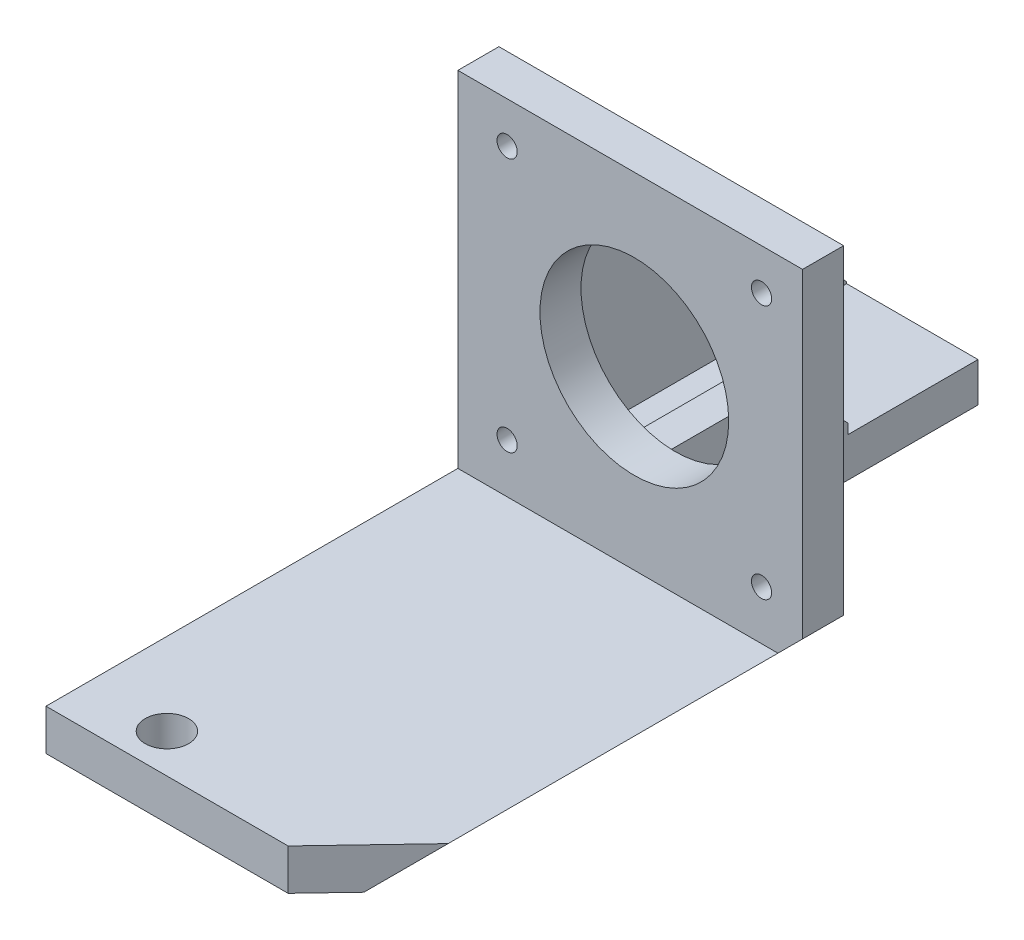
ISO-10303-21;
HEADER;
FILE_DESCRIPTION(('STEP AP214'),'2;1');
FILE_NAME('part.step','',(''),(''),'','','');
FILE_SCHEMA(('AUTOMOTIVE_DESIGN { 1 0 10303 214 1 1 1 1 }'));
ENDSEC;
DATA;
#1=APPLICATION_CONTEXT('core data for automotive mechanical design processes');
#2=APPLICATION_PROTOCOL_DEFINITION('international standard','automotive_design',2000,#1);
#3=PRODUCT_CONTEXT('',#1,'mechanical');
#4=PRODUCT('Part','Part','',(#3));
#5=PRODUCT_RELATED_PRODUCT_CATEGORY('part','',(#4));
#6=PRODUCT_DEFINITION_FORMATION('','',#4);
#7=PRODUCT_DEFINITION_CONTEXT('part definition',#1,'design');
#8=PRODUCT_DEFINITION('design','',#6,#7);
#9=PRODUCT_DEFINITION_SHAPE('','',#8);
#10=(LENGTH_UNIT() NAMED_UNIT(*) SI_UNIT(.MILLI.,.METRE.));
#11=(NAMED_UNIT(*) PLANE_ANGLE_UNIT() SI_UNIT($,.RADIAN.));
#12=(NAMED_UNIT(*) SI_UNIT($,.STERADIAN.) SOLID_ANGLE_UNIT());
#13=UNCERTAINTY_MEASURE_WITH_UNIT(LENGTH_MEASURE(1.E-05),#10,'distance_accuracy_value','');
#14=(GEOMETRIC_REPRESENTATION_CONTEXT(3) GLOBAL_UNCERTAINTY_ASSIGNED_CONTEXT((#13)) GLOBAL_UNIT_ASSIGNED_CONTEXT((#10,
#11,#12)) REPRESENTATION_CONTEXT('',''));
#15=CARTESIAN_POINT('',(0.,0.,0.));
#16=DIRECTION('',(0.,0.,1.));
#17=DIRECTION('',(1.,0.,0.));
#18=AXIS2_PLACEMENT_3D('',#15,#16,#17);
#19=CARTESIAN_POINT('',(-174.000000052158,-112.694250021961,-39.4500000000026));
#20=DIRECTION('',(0.,0.,1.));
#21=DIRECTION('',(1.,0.,0.));
#22=AXIS2_PLACEMENT_3D('',#19,#20,#21);
#23=CYLINDRICAL_SURFACE('',#22,1.23);
#24=CARTESIAN_POINT('',(-174.000000052157,-112.694250021962,-30.4500000000025));
#25=DIRECTION('',(0.,0.,-1.));
#26=DIRECTION('',(1.,0.,0.));
#27=AXIS2_PLACEMENT_3D('',#24,#25,#26);
#28=CIRCLE('',#27,1.23);
#29=CARTESIAN_POINT('',(-175.230000052157,-112.694250021962,-30.4500000000025));
#30=VERTEX_POINT('',#29);
#31=EDGE_CURVE('E403',#30,#30,#28,.T.);
#32=ORIENTED_EDGE('',*,*,#31,.T.);
#33=DIRECTION('',(0.,0.,1.));
#34=VECTOR('',#33,1.);
#35=CARTESIAN_POINT('',(-175.230000052158,-112.694250021961,-39.4500000000025));
#36=LINE('',#35,#34);
#37=CARTESIAN_POINT('',(-175.230000052157,-112.694250021962,-25.4500000000025));
#38=VERTEX_POINT('',#37);
#39=EDGE_CURVE('E11',#30,#38,#36,.T.);
#40=ORIENTED_EDGE('',*,*,#39,.T.);
#41=CARTESIAN_POINT('',(-174.000000052157,-112.694250021962,-25.4500000000026));
#42=DIRECTION('',(0.,0.,-1.));
#43=DIRECTION('',(1.,0.,0.));
#44=AXIS2_PLACEMENT_3D('',#41,#42,#43);
#45=CIRCLE('',#44,1.23);
#46=EDGE_CURVE('E370',#38,#38,#45,.T.);
#47=ORIENTED_EDGE('',*,*,#46,.F.);
#48=ORIENTED_EDGE('',*,*,#39,.F.);
#49=EDGE_LOOP('',(#32,#40,#47,#48));
#50=FACE_BOUND('',#49,.T.);
#51=ADVANCED_FACE('F16',(#50),#23,.F.);
#52=CARTESIAN_POINT('',(-174.000000052157,-143.694250021961,-39.4500000000027));
#53=DIRECTION('',(0.,0.,1.));
#54=DIRECTION('',(1.,0.,0.));
#55=AXIS2_PLACEMENT_3D('',#52,#53,#54);
#56=CYLINDRICAL_SURFACE('',#55,1.23);
#57=CARTESIAN_POINT('',(-174.000000052157,-143.694250021961,-30.4500000000028));
#58=DIRECTION('',(0.,0.,-1.));
#59=DIRECTION('',(1.,0.,0.));
#60=AXIS2_PLACEMENT_3D('',#57,#58,#59);
#61=CIRCLE('',#60,1.23);
#62=CARTESIAN_POINT('',(-175.230000052157,-143.694250021961,-30.4500000000027));
#63=VERTEX_POINT('',#62);
#64=EDGE_CURVE('E399',#63,#63,#61,.T.);
#65=ORIENTED_EDGE('',*,*,#64,.T.);
#66=DIRECTION('',(0.,0.,1.));
#67=VECTOR('',#66,1.);
#68=CARTESIAN_POINT('',(-175.230000052157,-143.694250021961,-39.4500000000027));
#69=LINE('',#68,#67);
#70=CARTESIAN_POINT('',(-175.230000052157,-143.694250021962,-25.4500000000027));
#71=VERTEX_POINT('',#70);
#72=EDGE_CURVE('E20',#63,#71,#69,.T.);
#73=ORIENTED_EDGE('',*,*,#72,.T.);
#74=CARTESIAN_POINT('',(-174.000000052157,-143.694250021962,-25.4500000000027));
#75=DIRECTION('',(0.,0.,-1.));
#76=DIRECTION('',(1.,0.,0.));
#77=AXIS2_PLACEMENT_3D('',#74,#75,#76);
#78=CIRCLE('',#77,1.23);
#79=EDGE_CURVE('E424',#71,#71,#78,.T.);
#80=ORIENTED_EDGE('',*,*,#79,.F.);
#81=ORIENTED_EDGE('',*,*,#72,.F.);
#82=EDGE_LOOP('',(#65,#73,#80,#81));
#83=FACE_BOUND('',#82,.T.);
#84=ADVANCED_FACE('F864',(#83),#56,.F.);
#85=CARTESIAN_POINT('',(-143.000000052158,-112.694250021961,-39.4500000000036));
#86=DIRECTION('',(0.,0.,1.));
#87=DIRECTION('',(1.,0.,0.));
#88=AXIS2_PLACEMENT_3D('',#85,#86,#87);
#89=CYLINDRICAL_SURFACE('',#88,1.23);
#90=CARTESIAN_POINT('',(-143.000000052157,-112.694250021961,-30.4500000000035));
#91=DIRECTION('',(0.,0.,-1.));
#92=DIRECTION('',(1.,0.,0.));
#93=AXIS2_PLACEMENT_3D('',#90,#91,#92);
#94=CIRCLE('',#93,1.23);
#95=CARTESIAN_POINT('',(-144.230000052157,-112.694250021961,-30.4500000000035));
#96=VERTEX_POINT('',#95);
#97=EDGE_CURVE('E239',#96,#96,#94,.T.);
#98=ORIENTED_EDGE('',*,*,#97,.T.);
#99=DIRECTION('',(0.,0.,1.));
#100=VECTOR('',#99,1.);
#101=CARTESIAN_POINT('',(-144.230000052157,-112.694250021961,-39.4500000000035));
#102=LINE('',#101,#100);
#103=CARTESIAN_POINT('',(-144.230000052157,-112.694250021961,-25.4500000000035));
#104=VERTEX_POINT('',#103);
#105=EDGE_CURVE('E236',#96,#104,#102,.T.);
#106=ORIENTED_EDGE('',*,*,#105,.T.);
#107=CARTESIAN_POINT('',(-143.000000052157,-112.694250021961,-25.4500000000036));
#108=DIRECTION('',(0.,0.,-1.));
#109=DIRECTION('',(1.,0.,0.));
#110=AXIS2_PLACEMENT_3D('',#107,#108,#109);
#111=CIRCLE('',#110,1.23);
#112=EDGE_CURVE('E241',#104,#104,#111,.T.);
#113=ORIENTED_EDGE('',*,*,#112,.F.);
#114=ORIENTED_EDGE('',*,*,#105,.F.);
#115=EDGE_LOOP('',(#98,#106,#113,#114));
#116=FACE_BOUND('',#115,.T.);
#117=ADVANCED_FACE('F237',(#116),#89,.F.);
#118=CARTESIAN_POINT('',(-143.000000052157,-143.694250021961,-39.4500000000037));
#119=DIRECTION('',(0.,0.,1.));
#120=DIRECTION('',(1.,0.,0.));
#121=AXIS2_PLACEMENT_3D('',#118,#119,#120);
#122=CYLINDRICAL_SURFACE('',#121,1.23);
#123=CARTESIAN_POINT('',(-143.000000052157,-143.694250021961,-30.4500000000037));
#124=DIRECTION('',(0.,0.,-1.));
#125=DIRECTION('',(1.,0.,0.));
#126=AXIS2_PLACEMENT_3D('',#123,#124,#125);
#127=CIRCLE('',#126,1.23);
#128=CARTESIAN_POINT('',(-144.230000052157,-143.694250021961,-30.4500000000037));
#129=VERTEX_POINT('',#128);
#130=EDGE_CURVE('E383',#129,#129,#127,.T.);
#131=ORIENTED_EDGE('',*,*,#130,.T.);
#132=DIRECTION('',(0.,0.,1.));
#133=VECTOR('',#132,1.);
#134=CARTESIAN_POINT('',(-144.230000052157,-143.694250021961,-39.4500000000037));
#135=LINE('',#134,#133);
#136=CARTESIAN_POINT('',(-144.230000052157,-143.694250021961,-25.4500000000037));
#137=VERTEX_POINT('',#136);
#138=EDGE_CURVE('E120',#129,#137,#135,.T.);
#139=ORIENTED_EDGE('',*,*,#138,.T.);
#140=CARTESIAN_POINT('',(-143.000000052157,-143.694250021961,-25.4500000000037));
#141=DIRECTION('',(0.,0.,-1.));
#142=DIRECTION('',(1.,0.,0.));
#143=AXIS2_PLACEMENT_3D('',#140,#141,#142);
#144=CIRCLE('',#143,1.23);
#145=EDGE_CURVE('E252',#137,#137,#144,.T.);
#146=ORIENTED_EDGE('',*,*,#145,.F.);
#147=ORIENTED_EDGE('',*,*,#138,.F.);
#148=EDGE_LOOP('',(#131,#139,#146,#147));
#149=FACE_BOUND('',#148,.T.);
#150=ADVANCED_FACE('F672',(#149),#122,.F.);
#151=CARTESIAN_POINT('',(-180.00025649192,-150.000002235174,-69.0000013261975));
#152=DIRECTION('',(0.,1.,0.));
#153=DIRECTION('',(0.,0.,-1.));
#154=AXIS2_PLACEMENT_3D('',#151,#152,#153);
#155=PLANE('',#154);
#156=DIRECTION('',(0.,0.,1.));
#157=VECTOR('',#156,1.);
#158=CARTESIAN_POINT('',(-180.000000052441,-150.000002235174,-54.2250006631001));
#159=LINE('',#158,#157);
#160=CARTESIAN_POINT('',(-180.000000052442,-150.000002235174,-69.0000013261975));
#161=VERTEX_POINT('',#160);
#162=CARTESIAN_POINT('',(-180.000000052442,-150.000002235174,-68.8225735100148));
#163=VERTEX_POINT('',#162);
#164=EDGE_CURVE('E362',#161,#163,#159,.T.);
#165=ORIENTED_EDGE('',*,*,#164,.T.);
#166=DIRECTION('',(0.,0.,1.));
#167=VECTOR('',#166,1.);
#168=CARTESIAN_POINT('',(-180.000000052441,-150.000002235174,-54.2250006631001));
#169=LINE('',#168,#167);
#170=CARTESIAN_POINT('',(-180.000000052441,-150.000002235174,-44.4500000000023));
#171=VERTEX_POINT('',#170);
#172=EDGE_CURVE('E275',#163,#171,#169,.T.);
#173=ORIENTED_EDGE('',*,*,#172,.T.);
#174=DIRECTION('',(1.,0.,0.));
#175=VECTOR('',#174,1.);
#176=CARTESIAN_POINT('',(-180.000256491919,-150.000002235174,-44.4500000000023));
#177=LINE('',#176,#175);
#178=CARTESIAN_POINT('',(-180.000256491919,-150.000002235174,-44.4500000000023));
#179=VERTEX_POINT('',#178);
#180=EDGE_CURVE('E266',#179,#171,#177,.T.);
#181=ORIENTED_EDGE('',*,*,#180,.F.);
#182=DIRECTION('',(0.,0.,1.));
#183=VECTOR('',#182,1.);
#184=CARTESIAN_POINT('',(-180.00025649192,-150.000002235174,-69.0000013261975));
#185=LINE('',#184,#183);
#186=CARTESIAN_POINT('',(-180.00025649192,-150.000002235174,-69.0000013261975));
#187=VERTEX_POINT('',#186);
#188=EDGE_CURVE('E334',#187,#179,#185,.T.);
#189=ORIENTED_EDGE('',*,*,#188,.F.);
#190=DIRECTION('',(1.,0.,0.));
#191=VECTOR('',#190,1.);
#192=CARTESIAN_POINT('',(-180.00025649192,-150.000002235174,-69.0000013261975));
#193=LINE('',#192,#191);
#194=EDGE_CURVE('E107',#187,#161,#193,.T.);
#195=ORIENTED_EDGE('',*,*,#194,.T.);
#196=EDGE_LOOP('',(#165,#173,#181,#189,#195));
#197=FACE_BOUND('',#196,.T.);
#198=ADVANCED_FACE('F964',(#197),#155,.F.);
#199=CARTESIAN_POINT('',(-180.000256491919,-107.694249950324,-44.4500000000023));
#200=DIRECTION('',(0.,-0.501911828507545,0.864918791797365));
#201=DIRECTION('',(-1.,0.,0.));
#202=AXIS2_PLACEMENT_3D('',#199,#200,#201);
#203=PLANE('',#202);
#204=DIRECTION('',(1.,0.,0.));
#205=VECTOR('',#204,1.);
#206=CARTESIAN_POINT('',(-178.00025649192,-149.694250021961,-68.8225735100149));
#207=LINE('',#206,#205);
#208=CARTESIAN_POINT('',(-180.00025649192,-149.694250021961,-68.8225735100148));
#209=VERTEX_POINT('',#208);
#210=CARTESIAN_POINT('',(-180.000000052158,-149.694250021961,-68.8225735100148));
#211=VERTEX_POINT('',#210);
#212=EDGE_CURVE('E259',#209,#211,#207,.T.);
#213=ORIENTED_EDGE('',*,*,#212,.T.);
#214=DIRECTION('',(0.,-0.864918791797365,-0.501911828507545));
#215=VECTOR('',#214,1.);
#216=CARTESIAN_POINT('',(-180.000000052441,-107.99559620047,-44.6248710386004));
#217=LINE('',#216,#215);
#218=EDGE_CURVE('E355',#211,#161,#217,.T.);
#219=ORIENTED_EDGE('',*,*,#218,.T.);
#220=ORIENTED_EDGE('',*,*,#194,.F.);
#221=DIRECTION('',(0.,-0.864918791797365,-0.501911828507545));
#222=VECTOR('',#221,1.);
#223=CARTESIAN_POINT('',(-180.000256491919,-107.694249950324,-44.4500000000023));
#224=LINE('',#223,#222);
#225=EDGE_CURVE('E330',#209,#187,#224,.T.);
#226=ORIENTED_EDGE('',*,*,#225,.F.);
#227=EDGE_LOOP('',(#213,#219,#220,#226));
#228=FACE_BOUND('',#227,.T.);
#229=ADVANCED_FACE('F885',(#228),#203,.F.);
#230=CARTESIAN_POINT('',(-180.000256491919,-150.000002235174,-44.4500000000023));
#231=DIRECTION('',(0.,0.,-1.));
#232=DIRECTION('',(-1.,0.,0.));
#233=AXIS2_PLACEMENT_3D('',#230,#231,#232);
#234=PLANE('',#233);
#235=DIRECTION('',(-1.,0.,0.));
#236=VECTOR('',#235,1.);
#237=CARTESIAN_POINT('',(-178.000256491919,-123.017694463356,-44.4500000000024));
#238=LINE('',#237,#236);
#239=CARTESIAN_POINT('',(-180.000000052441,-123.017694463356,-44.4500000000023));
#240=VERTEX_POINT('',#239);
#241=CARTESIAN_POINT('',(-180.000256491919,-123.017694463356,-44.4500000000023));
#242=VERTEX_POINT('',#241);
#243=EDGE_CURVE('E258',#240,#242,#238,.T.);
#244=ORIENTED_EDGE('',*,*,#243,.T.);
#245=DIRECTION('',(0.,1.,0.));
#246=VECTOR('',#245,1.);
#247=CARTESIAN_POINT('',(-180.000256491919,-150.000002235174,-44.4500000000023));
#248=LINE('',#247,#246);
#249=EDGE_CURVE('E354',#179,#242,#248,.T.);
#250=ORIENTED_EDGE('',*,*,#249,.F.);
#251=ORIENTED_EDGE('',*,*,#180,.T.);
#252=DIRECTION('',(0.,1.,0.));
#253=VECTOR('',#252,1.);
#254=CARTESIAN_POINT('',(-180.000000052441,-130.700698316867,-44.4500000000023));
#255=LINE('',#254,#253);
#256=EDGE_CURVE('E329',#171,#240,#255,.T.);
#257=ORIENTED_EDGE('',*,*,#256,.T.);
#258=EDGE_LOOP('',(#244,#250,#251,#257));
#259=FACE_BOUND('',#258,.T.);
#260=ADVANCED_FACE('F503',(#259),#234,.F.);
#261=CARTESIAN_POINT('',(-176.00025649192,-128.847126092749,-56.7250006631));
#262=DIRECTION('',(-1.,0.,0.));
#263=DIRECTION('',(0.,1.,0.));
#264=AXIS2_PLACEMENT_3D('',#261,#262,#263);
#265=PLANE('',#264);
#266=DIRECTION('',(0.,0.738268850320512,0.674506563827536));
#267=VECTOR('',#266,1.);
#268=CARTESIAN_POINT('',(-176.00025649192,-141.00088532556,-60.8800312411335));
#269=LINE('',#268,#267);
#270=CARTESIAN_POINT('',(-176.00025649192,-149.694250021961,-68.822573510015));
#271=VERTEX_POINT('',#270);
#272=CARTESIAN_POINT('',(-176.000256491919,-107.694249950324,-30.4500000000024));
#273=VERTEX_POINT('',#272);
#274=EDGE_CURVE('E309',#271,#273,#269,.T.);
#275=ORIENTED_EDGE('',*,*,#274,.T.);
#276=DIRECTION('',(0.,-1.,0.));
#277=VECTOR('',#276,1.);
#278=CARTESIAN_POINT('',(-176.000256491919,-149.694250021961,-30.4500000000024));
#279=LINE('',#278,#277);
#280=CARTESIAN_POINT('',(-176.000256491919,-149.894250021961,-30.4500000000024));
#281=VERTEX_POINT('',#280);
#282=EDGE_CURVE('E558',#273,#281,#279,.T.);
#283=ORIENTED_EDGE('',*,*,#282,.T.);
#284=DIRECTION('',(0.,0.,1.));
#285=VECTOR('',#284,1.);
#286=CARTESIAN_POINT('',(-176.000256491919,-149.894250021961,-44.4500000000024));
#287=LINE('',#286,#285);
#288=CARTESIAN_POINT('',(-176.00025649192,-149.894250021961,-68.822573510015));
#289=VERTEX_POINT('',#288);
#290=EDGE_CURVE('E319',#289,#281,#287,.T.);
#291=ORIENTED_EDGE('',*,*,#290,.F.);
#292=DIRECTION('',(0.,-1.,0.));
#293=VECTOR('',#292,1.);
#294=CARTESIAN_POINT('',(-176.00025649192,-149.694250021961,-68.822573510015));
#295=LINE('',#294,#293);
#296=EDGE_CURVE('E365',#271,#289,#295,.T.);
#297=ORIENTED_EDGE('',*,*,#296,.F.);
#298=EDGE_LOOP('',(#275,#283,#291,#297));
#299=FACE_BOUND('',#298,.T.);
#300=ADVANCED_FACE('F884',(#299),#265,.F.);
#301=CARTESIAN_POINT('',(-158.500000052158,-128.194250021961,-44.4500000000031));
#302=DIRECTION('',(0.,0.,-1.));
#303=DIRECTION('',(-1.,0.,0.));
#304=AXIS2_PLACEMENT_3D('',#301,#302,#303);
#305=CYLINDRICAL_SURFACE('',#304,11.5);
#306=CARTESIAN_POINT('',(-158.500000052157,-128.194250021961,-25.4500000000031));
#307=DIRECTION('',(0.,0.,-1.));
#308=DIRECTION('',(-1.,0.,0.));
#309=AXIS2_PLACEMENT_3D('',#306,#307,#308);
#310=CIRCLE('',#309,11.5);
#311=CARTESIAN_POINT('',(-147.000000052157,-128.194250021961,-25.4500000000035));
#312=VERTEX_POINT('',#311);
#313=EDGE_CURVE('E366',#312,#312,#310,.T.);
#314=ORIENTED_EDGE('',*,*,#313,.F.);
#315=DIRECTION('',(0.,0.,-1.));
#316=VECTOR('',#315,1.);
#317=CARTESIAN_POINT('',(-147.000000052158,-128.194250021961,-44.4500000000035));
#318=LINE('',#317,#316);
#319=CARTESIAN_POINT('',(-147.000000052157,-128.194250021961,-30.4500000000035));
#320=VERTEX_POINT('',#319);
#321=EDGE_CURVE('E270',#312,#320,#318,.T.);
#322=ORIENTED_EDGE('',*,*,#321,.T.);
#323=CARTESIAN_POINT('',(-158.500000052157,-128.194250021961,-30.4500000000031));
#324=DIRECTION('',(0.,0.,-1.));
#325=DIRECTION('',(-1.,0.,0.));
#326=AXIS2_PLACEMENT_3D('',#323,#324,#325);
#327=CIRCLE('',#326,11.5);
#328=EDGE_CURVE('E386',#320,#320,#327,.T.);
#329=ORIENTED_EDGE('',*,*,#328,.T.);
#330=ORIENTED_EDGE('',*,*,#321,.F.);
#331=EDGE_LOOP('',(#314,#322,#329,#330));
#332=FACE_BOUND('',#331,.T.);
#333=ADVANCED_FACE('F18',(#332),#305,.F.);
#334=CARTESIAN_POINT('',(-161.500001173424,-140.694250021961,-53.7250006184001));
#335=DIRECTION('',(0.,-1.,0.));
#336=DIRECTION('',(0.,0.,-1.));
#337=AXIS2_PLACEMENT_3D('',#334,#335,#336);
#338=PLANE('',#337);
#339=DIRECTION('',(0.,0.,1.));
#340=VECTOR('',#339,1.);
#341=CARTESIAN_POINT('',(-160.00000005207,-140.694250021961,-74.862500309202));
#342=LINE('',#341,#340);
#343=CARTESIAN_POINT('',(-160.00000005207,-140.694250021961,-45.000001236797));
#344=VERTEX_POINT('',#343);
#345=CARTESIAN_POINT('',(-160.000000052069,-140.694250021961,-30.4500000000032));
#346=VERTEX_POINT('',#345);
#347=EDGE_CURVE('E479',#344,#346,#342,.T.);
#348=ORIENTED_EDGE('',*,*,#347,.F.);
#349=DIRECTION('',(-1.,0.,0.));
#350=VECTOR('',#349,1.);
#351=CARTESIAN_POINT('',(-162.750001734102,-140.694250021961,-45.000001236797));
#352=LINE('',#351,#350);
#353=CARTESIAN_POINT('',(-164.000002294779,-140.694250021961,-45.000001236797));
#354=VERTEX_POINT('',#353);
#355=EDGE_CURVE('E375',#344,#354,#352,.T.);
#356=ORIENTED_EDGE('',*,*,#355,.T.);
#357=DIRECTION('',(0.,0.,-1.));
#358=VECTOR('',#357,1.);
#359=CARTESIAN_POINT('',(-164.000002294779,-140.694250021961,-44.4500000000032));
#360=LINE('',#359,#358);
#361=CARTESIAN_POINT('',(-164.000002294778,-140.694250021961,-30.4500000000032));
#362=VERTEX_POINT('',#361);
#363=EDGE_CURVE('E40',#362,#354,#360,.T.);
#364=ORIENTED_EDGE('',*,*,#363,.F.);
#365=DIRECTION('',(1.,0.,0.));
#366=VECTOR('',#365,1.);
#367=CARTESIAN_POINT('',(-160.00000061279,-140.694250021961,-30.4500000000032));
#368=LINE('',#367,#366);
#369=EDGE_CURVE('E414',#362,#346,#368,.T.);
#370=ORIENTED_EDGE('',*,*,#369,.T.);
#371=EDGE_LOOP('',(#348,#356,#364,#370));
#372=FACE_BOUND('',#371,.T.);
#373=ADVANCED_FACE('F643',(#372),#338,.F.);
#374=CARTESIAN_POINT('',(-164.000002294779,-149.694250021961,-44.4500000000033));
#375=DIRECTION('',(1.,0.,0.));
#376=DIRECTION('',(0.,0.,1.));
#377=AXIS2_PLACEMENT_3D('',#374,#375,#376);
#378=PLANE('',#377);
#379=DIRECTION('',(0.,-0.707106781186544,-0.707106781186551));
#380=VECTOR('',#379,1.);
#381=CARTESIAN_POINT('',(-164.000002294779,-144.806749712763,-49.1125009275985));
#382=LINE('',#381,#380);
#383=CARTESIAN_POINT('',(-164.000002294779,-148.694250021961,-53.000001236797));
#384=VERTEX_POINT('',#383);
#385=EDGE_CURVE('E372',#354,#384,#382,.T.);
#386=ORIENTED_EDGE('',*,*,#385,.T.);
#387=DIRECTION('',(0.,1.,0.));
#388=VECTOR('',#387,1.);
#389=CARTESIAN_POINT('',(-164.000002294779,-149.694250021961,-53.000001236797));
#390=LINE('',#389,#388);
#391=CARTESIAN_POINT('',(-164.000002294779,-149.894250021961,-53.000001236797));
#392=VERTEX_POINT('',#391);
#393=EDGE_CURVE('E450',#392,#384,#390,.T.);
#394=ORIENTED_EDGE('',*,*,#393,.F.);
#395=DIRECTION('',(0.,0.,-1.));
#396=VECTOR('',#395,1.);
#397=CARTESIAN_POINT('',(-164.000002294779,-149.894250021961,-10.4500000000036));
#398=LINE('',#397,#396);
#399=CARTESIAN_POINT('',(-164.000002294778,-149.894250021961,-30.4500000000033));
#400=VERTEX_POINT('',#399);
#401=EDGE_CURVE('E344',#400,#392,#398,.T.);
#402=ORIENTED_EDGE('',*,*,#401,.F.);
#403=DIRECTION('',(0.,1.,0.));
#404=VECTOR('',#403,1.);
#405=CARTESIAN_POINT('',(-164.000002294778,-138.944250021961,-30.450000000003));
#406=LINE('',#405,#404);
#407=EDGE_CURVE('E469',#400,#362,#406,.T.);
#408=ORIENTED_EDGE('',*,*,#407,.T.);
#409=ORIENTED_EDGE('',*,*,#363,.T.);
#410=EDGE_LOOP('',(#386,#394,#402,#408,#409));
#411=FACE_BOUND('',#410,.T.);
#412=ADVANCED_FACE('F936',(#411),#378,.F.);
#413=CARTESIAN_POINT('',(-162.750001734102,-144.694250021961,-49.000001236797));
#414=DIRECTION('',(0.,-0.707106781186551,0.707106781186544));
#415=DIRECTION('',(-1.,0.,0.));
#416=AXIS2_PLACEMENT_3D('',#413,#414,#415);
#417=PLANE('',#416);
#418=DIRECTION('',(0.,0.707106781186544,0.707106781186551));
#419=VECTOR('',#418,1.);
#420=CARTESIAN_POINT('',(-160.00000005207,-157.694249712763,-62.0000009275988));
#421=LINE('',#420,#419);
#422=CARTESIAN_POINT('',(-160.00000005207,-148.694250021961,-53.000001236797));
#423=VERTEX_POINT('',#422);
#424=EDGE_CURVE('E449',#423,#344,#421,.T.);
#425=ORIENTED_EDGE('',*,*,#424,.F.);
#426=DIRECTION('',(1.,0.,0.));
#427=VECTOR('',#426,1.);
#428=CARTESIAN_POINT('',(-162.750001734102,-148.694250021961,-53.000001236797));
#429=LINE('',#428,#427);
#430=EDGE_CURVE('E376',#384,#423,#429,.T.);
#431=ORIENTED_EDGE('',*,*,#430,.F.);
#432=ORIENTED_EDGE('',*,*,#385,.F.);
#433=ORIENTED_EDGE('',*,*,#355,.F.);
#434=EDGE_LOOP('',(#425,#431,#432,#433));
#435=FACE_BOUND('',#434,.T.);
#436=ADVANCED_FACE('F639',(#435),#417,.F.);
#437=CARTESIAN_POINT('',(-164.000002294779,-149.694250021961,-53.000001236797));
#438=DIRECTION('',(0.,0.,-1.));
#439=DIRECTION('',(-1.,0.,0.));
#440=AXIS2_PLACEMENT_3D('',#437,#438,#439);
#441=PLANE('',#440);
#442=DIRECTION('',(0.,1.,0.));
#443=VECTOR('',#442,1.);
#444=CARTESIAN_POINT('',(-160.00000005207,-149.694250021961,-53.000001236797));
#445=LINE('',#444,#443);
#446=CARTESIAN_POINT('',(-160.00000005207,-149.894250021961,-53.000001236797));
#447=VERTEX_POINT('',#446);
#448=EDGE_CURVE('E435',#447,#423,#445,.T.);
#449=ORIENTED_EDGE('',*,*,#448,.F.);
#450=DIRECTION('',(1.,0.,0.));
#451=VECTOR('',#450,1.);
#452=CARTESIAN_POINT('',(-151.000001173379,-149.894250021961,-53.000001236797));
#453=LINE('',#452,#451);
#454=EDGE_CURVE('E281',#392,#447,#453,.T.);
#455=ORIENTED_EDGE('',*,*,#454,.F.);
#456=ORIENTED_EDGE('',*,*,#393,.T.);
#457=ORIENTED_EDGE('',*,*,#430,.T.);
#458=EDGE_LOOP('',(#449,#455,#456,#457));
#459=FACE_BOUND('',#458,.T.);
#460=ADVANCED_FACE('F914',(#459),#441,.T.);
#461=CARTESIAN_POINT('',(-138.000000052157,-144.987105592628,-39.4500000000039));
#462=DIRECTION('',(-1.,0.,0.));
#463=DIRECTION('',(0.,1.,0.));
#464=AXIS2_PLACEMENT_3D('',#461,#462,#463);
#465=PLANE('',#464);
#466=DIRECTION('',(0.,1.,0.));
#467=VECTOR('',#466,1.);
#468=CARTESIAN_POINT('',(-138.000000052157,-136.590677807295,-30.4500000000039));
#469=LINE('',#468,#467);
#470=CARTESIAN_POINT('',(-138.000000052157,-146.694250021961,-30.4500000000033));
#471=VERTEX_POINT('',#470);
#472=CARTESIAN_POINT('',(-138.000000052069,-107.694249950324,-30.4500000000037));
#473=VERTEX_POINT('',#472);
#474=EDGE_CURVE('E489',#471,#473,#469,.T.);
#475=ORIENTED_EDGE('',*,*,#474,.T.);
#476=DIRECTION('',(0.,0.,-1.));
#477=VECTOR('',#476,1.);
#478=CARTESIAN_POINT('',(-138.000000052069,-107.694249950324,-39.4500000000037));
#479=LINE('',#478,#477);
#480=CARTESIAN_POINT('',(-138.000000052069,-107.694249950324,-25.4500000000037));
#481=VERTEX_POINT('',#480);
#482=EDGE_CURVE('E265',#481,#473,#479,.T.);
#483=ORIENTED_EDGE('',*,*,#482,.F.);
#484=DIRECTION('',(0.,1.,0.));
#485=VECTOR('',#484,1.);
#486=CARTESIAN_POINT('',(-138.000000052157,-148.694250021961,-25.450000000004));
#487=LINE('',#486,#485);
#488=CARTESIAN_POINT('',(-138.000000052157,-146.694250021961,-25.4500000000039));
#489=VERTEX_POINT('',#488);
#490=EDGE_CURVE('E371',#489,#481,#487,.T.);
#491=ORIENTED_EDGE('',*,*,#490,.F.);
#492=DIRECTION('',(0.,0.,1.));
#493=VECTOR('',#492,1.);
#494=CARTESIAN_POINT('',(-138.000000052157,-146.694250021961,-39.4500000000039));
#495=LINE('',#494,#493);
#496=EDGE_CURVE('E287',#471,#489,#495,.T.);
#497=ORIENTED_EDGE('',*,*,#496,.F.);
#498=EDGE_LOOP('',(#475,#483,#491,#497));
#499=FACE_BOUND('',#498,.T.);
#500=ADVANCED_FACE('F698',(#499),#465,.F.);
#501=CARTESIAN_POINT('',(-180.000000052158,-149.694250021961,-68.8225735100148));
#502=DIRECTION('',(0.,0.,-1.));
#503=DIRECTION('',(-1.,0.,0.));
#504=AXIS2_PLACEMENT_3D('',#501,#502,#503);
#505=PLANE('',#504);
#506=DIRECTION('',(-1.,0.,0.));
#507=VECTOR('',#506,1.);
#508=CARTESIAN_POINT('',(-159.000128271951,-149.694250021961,-68.8225735100156));
#509=LINE('',#508,#507);
#510=EDGE_CURVE('E313',#271,#211,#509,.T.);
#511=ORIENTED_EDGE('',*,*,#510,.F.);
#512=ORIENTED_EDGE('',*,*,#296,.T.);
#513=DIRECTION('',(-1.,0.,0.));
#514=VECTOR('',#513,1.);
#515=CARTESIAN_POINT('',(-149.000000052024,-149.894250021961,-68.8225735100148));
#516=LINE('',#515,#514);
#517=CARTESIAN_POINT('',(-160.00000005207,-149.894250021961,-68.8225735100148));
#518=VERTEX_POINT('',#517);
#519=EDGE_CURVE('E315',#518,#289,#516,.T.);
#520=ORIENTED_EDGE('',*,*,#519,.F.);
#521=DIRECTION('',(0.,1.,0.));
#522=VECTOR('',#521,1.);
#523=CARTESIAN_POINT('',(-160.00000005207,-149.794250021961,-68.8225735100148));
#524=LINE('',#523,#522);
#525=CARTESIAN_POINT('',(-160.00000005207,-154.694250021961,-68.8225735100148));
#526=VERTEX_POINT('',#525);
#527=EDGE_CURVE('E274',#526,#518,#524,.T.);
#528=ORIENTED_EDGE('',*,*,#527,.F.);
#529=DIRECTION('',(1.,0.,0.));
#530=VECTOR('',#529,1.);
#531=CARTESIAN_POINT('',(-167.646427837619,-154.694250021961,-68.8225735100148));
#532=LINE('',#531,#530);
#533=CARTESIAN_POINT('',(-180.000000052158,-154.694250021961,-68.8225735100148));
#534=VERTEX_POINT('',#533);
#535=EDGE_CURVE('E298',#534,#526,#532,.T.);
#536=ORIENTED_EDGE('',*,*,#535,.F.);
#537=DIRECTION('',(0.,-1.,0.));
#538=VECTOR('',#537,1.);
#539=CARTESIAN_POINT('',(-180.000000052442,-130.647822210261,-68.8225735100147));
#540=LINE('',#539,#538);
#541=EDGE_CURVE('E271',#163,#534,#540,.T.);
#542=ORIENTED_EDGE('',*,*,#541,.F.);
#543=DIRECTION('',(0.,-1.,0.));
#544=VECTOR('',#543,1.);
#545=CARTESIAN_POINT('',(-180.000000052158,-149.694250021961,-68.8225735100148));
#546=LINE('',#545,#544);
#547=EDGE_CURVE('E359',#211,#163,#546,.T.);
#548=ORIENTED_EDGE('',*,*,#547,.F.);
#549=EDGE_LOOP('',(#511,#512,#520,#528,#536,#542,#548));
#550=FACE_BOUND('',#549,.T.);
#551=ADVANCED_FACE('F913',(#550),#505,.T.);
#552=CARTESIAN_POINT('',(-180.000000052159,-149.694250021961,-96.0000000000025));
#553=DIRECTION('',(1.,0.,0.));
#554=DIRECTION('',(0.,0.,-1.));
#555=AXIS2_PLACEMENT_3D('',#552,#553,#554);
#556=PLANE('',#555);
#557=ORIENTED_EDGE('',*,*,#218,.F.);
#558=ORIENTED_EDGE('',*,*,#547,.T.);
#559=ORIENTED_EDGE('',*,*,#164,.F.);
#560=EDGE_LOOP('',(#557,#558,#559));
#561=FACE_BOUND('',#560,.T.);
#562=ADVANCED_FACE('F689',(#561),#556,.T.);
#563=CARTESIAN_POINT('',(-158.500000052157,-128.194250021961,-25.4500000000031));
#564=DIRECTION('',(0.,0.,1.));
#565=DIRECTION('',(1.,0.,0.));
#566=AXIS2_PLACEMENT_3D('',#563,#564,#565);
#567=PLANE('',#566);
#568=ORIENTED_EDGE('',*,*,#145,.T.);
#569=EDGE_LOOP('',(#568));
#570=FACE_BOUND('',#569,.T.);
#571=ORIENTED_EDGE('',*,*,#112,.T.);
#572=EDGE_LOOP('',(#571));
#573=FACE_BOUND('',#572,.T.);
#574=ORIENTED_EDGE('',*,*,#79,.T.);
#575=EDGE_LOOP('',(#574));
#576=FACE_BOUND('',#575,.T.);
#577=ORIENTED_EDGE('',*,*,#46,.T.);
#578=EDGE_LOOP('',(#577));
#579=FACE_BOUND('',#578,.T.);
#580=ORIENTED_EDGE('',*,*,#313,.T.);
#581=EDGE_LOOP('',(#580));
#582=FACE_BOUND('',#581,.T.);
#583=DIRECTION('',(1.,0.,0.));
#584=VECTOR('',#583,1.);
#585=CARTESIAN_POINT('',(-149.750000052124,-149.694250021961,-25.4500000000036));
#586=LINE('',#585,#584);
#587=CARTESIAN_POINT('',(-180.000000052157,-149.694250021961,-25.4500000000026));
#588=VERTEX_POINT('',#587);
#589=CARTESIAN_POINT('',(-141.000000052091,-149.694250021961,-25.4500000000038));
#590=VERTEX_POINT('',#589);
#591=EDGE_CURVE('E537',#588,#590,#586,.T.);
#592=ORIENTED_EDGE('',*,*,#591,.T.);
#593=DIRECTION('',(0.70710678117877,0.707106781194325,0.));
#594=VECTOR('',#593,1.);
#595=CARTESIAN_POINT('',(-140.500000052,-149.19425002186,-25.4500000000039));
#596=LINE('',#595,#594);
#597=EDGE_CURVE('E282',#590,#489,#596,.T.);
#598=ORIENTED_EDGE('',*,*,#597,.T.);
#599=ORIENTED_EDGE('',*,*,#490,.T.);
#600=DIRECTION('',(-1.,0.,0.));
#601=VECTOR('',#600,1.);
#602=CARTESIAN_POINT('',(-141.52943730368,-107.694250021961,-25.4500000000036));
#603=LINE('',#602,#601);
#604=CARTESIAN_POINT('',(-180.000256491919,-107.694249950324,-25.4500000000023));
#605=VERTEX_POINT('',#604);
#606=EDGE_CURVE('E349',#481,#605,#603,.T.);
#607=ORIENTED_EDGE('',*,*,#606,.T.);
#608=DIRECTION('',(0.,-1.,0.));
#609=VECTOR('',#608,1.);
#610=CARTESIAN_POINT('',(-180.000256491919,-118.928836768922,-25.4500000000024));
#611=LINE('',#610,#609);
#612=CARTESIAN_POINT('',(-180.000256491919,-111.40139439856,-25.4500000000023));
#613=VERTEX_POINT('',#612);
#614=EDGE_CURVE('E411',#605,#613,#611,.T.);
#615=ORIENTED_EDGE('',*,*,#614,.T.);
#616=DIRECTION('',(1.,0.,0.));
#617=VECTOR('',#616,1.);
#618=CARTESIAN_POINT('',(-179.225256491919,-111.40139439856,-25.4500000000023));
#619=LINE('',#618,#617);
#620=CARTESIAN_POINT('',(-180.00000005244,-111.40139439856,-25.4500000000023));
#621=VERTEX_POINT('',#620);
#622=EDGE_CURVE('E264',#613,#621,#619,.T.);
#623=ORIENTED_EDGE('',*,*,#622,.T.);
#624=DIRECTION('',(0.,-1.,0.));
#625=VECTOR('',#624,1.);
#626=CARTESIAN_POINT('',(-180.000000052157,-131.797822210261,-25.4500000000025));
#627=LINE('',#626,#625);
#628=EDGE_CURVE('E286',#621,#588,#627,.T.);
#629=ORIENTED_EDGE('',*,*,#628,.T.);
#630=EDGE_LOOP('',(#592,#598,#599,#607,#615,#623,#629));
#631=FACE_BOUND('',#630,.T.);
#632=ADVANCED_FACE('F671',(#570,#573,#576,#579,#582,#631),#567,.T.);
#633=CARTESIAN_POINT('',(-158.500000052157,-128.194250021961,-30.4500000000031));
#634=DIRECTION('',(0.,0.,1.));
#635=DIRECTION('',(1.,0.,0.));
#636=AXIS2_PLACEMENT_3D('',#633,#634,#635);
#637=PLANE('',#636);
#638=ORIENTED_EDGE('',*,*,#328,.F.);
#639=EDGE_LOOP('',(#638));
#640=FACE_BOUND('',#639,.T.);
#641=ORIENTED_EDGE('',*,*,#130,.F.);
#642=EDGE_LOOP('',(#641));
#643=FACE_BOUND('',#642,.T.);
#644=ORIENTED_EDGE('',*,*,#97,.F.);
#645=EDGE_LOOP('',(#644));
#646=FACE_BOUND('',#645,.T.);
#647=ORIENTED_EDGE('',*,*,#64,.F.);
#648=EDGE_LOOP('',(#647));
#649=FACE_BOUND('',#648,.T.);
#650=ORIENTED_EDGE('',*,*,#31,.F.);
#651=EDGE_LOOP('',(#650));
#652=FACE_BOUND('',#651,.T.);
#653=DIRECTION('',(0.70710678117877,0.707106781194325,0.));
#654=VECTOR('',#653,1.);
#655=CARTESIAN_POINT('',(-140.500000052,-149.19425002186,-30.4500000000039));
#656=LINE('',#655,#654);
#657=CARTESIAN_POINT('',(-146.000000051981,-154.694250021961,-30.4500000000033));
#658=VERTEX_POINT('',#657);
#659=EDGE_CURVE('E308',#658,#471,#656,.T.);
#660=ORIENTED_EDGE('',*,*,#659,.F.);
#661=DIRECTION('',(1.,0.,0.));
#662=VECTOR('',#661,1.);
#663=CARTESIAN_POINT('',(-166.896427837663,-154.694250021961,-30.450000000003));
#664=LINE('',#663,#662);
#665=CARTESIAN_POINT('',(-160.000000052069,-154.694250021961,-30.4500000000033));
#666=VERTEX_POINT('',#665);
#667=EDGE_CURVE('E387',#666,#658,#664,.T.);
#668=ORIENTED_EDGE('',*,*,#667,.F.);
#669=DIRECTION('',(0.,-1.,0.));
#670=VECTOR('',#669,1.);
#671=CARTESIAN_POINT('',(-160.000000052069,-149.694250021961,-30.4500000000033));
#672=LINE('',#671,#670);
#673=EDGE_CURVE('E320',#346,#666,#672,.T.);
#674=ORIENTED_EDGE('',*,*,#673,.F.);
#675=ORIENTED_EDGE('',*,*,#369,.F.);
#676=ORIENTED_EDGE('',*,*,#407,.F.);
#677=DIRECTION('',(1.,0.,0.));
#678=VECTOR('',#677,1.);
#679=CARTESIAN_POINT('',(-148.250000052069,-149.894250021961,-30.4500000000036));
#680=LINE('',#679,#678);
#681=EDGE_CURVE('E440',#281,#400,#680,.T.);
#682=ORIENTED_EDGE('',*,*,#681,.F.);
#683=ORIENTED_EDGE('',*,*,#282,.F.);
#684=DIRECTION('',(-1.,0.,0.));
#685=VECTOR('',#684,1.);
#686=CARTESIAN_POINT('',(-150.103572266652,-107.694250021961,-30.4500000000033));
#687=LINE('',#686,#685);
#688=EDGE_CURVE('E260',#473,#273,#687,.T.);
#689=ORIENTED_EDGE('',*,*,#688,.F.);
#690=ORIENTED_EDGE('',*,*,#474,.F.);
#691=EDGE_LOOP('',(#660,#668,#674,#675,#676,#682,#683,#689,#690));
#692=FACE_BOUND('',#691,.T.);
#693=ADVANCED_FACE('F675',(#640,#643,#646,#649,#652,#692),#637,.F.);
#694=CARTESIAN_POINT('',(-180.000256491919,-107.694249950324,-39.4500000000023));
#695=DIRECTION('',(1.,0.,0.));
#696=DIRECTION('',(0.,0.,-1.));
#697=AXIS2_PLACEMENT_3D('',#694,#695,#696);
#698=PLANE('',#697);
#699=DIRECTION('',(0.,-0.738268850320512,-0.674506563827536));
#700=VECTOR('',#699,1.);
#701=CARTESIAN_POINT('',(-180.00025649192,-130.93510232049,-51.6836027259175));
#702=LINE('',#701,#700);
#703=CARTESIAN_POINT('',(-180.000256491919,-107.694249950324,-30.4500000000023));
#704=VERTEX_POINT('',#703);
#705=CARTESIAN_POINT('',(-180.000256491919,-111.40139439856,-33.8369683954679));
#706=VERTEX_POINT('',#705);
#707=EDGE_CURVE('E395',#704,#706,#702,.T.);
#708=ORIENTED_EDGE('',*,*,#707,.T.);
#709=DIRECTION('',(0.,0.,1.));
#710=VECTOR('',#709,1.);
#711=CARTESIAN_POINT('',(-180.000256491919,-111.40139439856,-39.4500000000023));
#712=LINE('',#711,#710);
#713=EDGE_CURVE('E335',#706,#613,#712,.T.);
#714=ORIENTED_EDGE('',*,*,#713,.T.);
#715=ORIENTED_EDGE('',*,*,#614,.F.);
#716=DIRECTION('',(0.,0.,1.));
#717=VECTOR('',#716,1.);
#718=CARTESIAN_POINT('',(-180.000256491919,-107.694249950324,-39.4500000000023));
#719=LINE('',#718,#717);
#720=EDGE_CURVE('E345',#704,#605,#719,.T.);
#721=ORIENTED_EDGE('',*,*,#720,.F.);
#722=EDGE_LOOP('',(#708,#714,#715,#721));
#723=FACE_BOUND('',#722,.T.);
#724=ADVANCED_FACE('F604',(#723),#698,.F.);
#725=CARTESIAN_POINT('',(-180.000256491919,-107.694249950324,-39.4500000000023));
#726=DIRECTION('',(1.,0.,0.));
#727=DIRECTION('',(0.,0.,-1.));
#728=AXIS2_PLACEMENT_3D('',#725,#726,#727);
#729=PLANE('',#728);
#730=DIRECTION('',(0.,-0.738268850320512,-0.674506563827536));
#731=VECTOR('',#730,1.);
#732=CARTESIAN_POINT('',(-180.00025649192,-130.93510232049,-51.6836027259175));
#733=LINE('',#732,#731);
#734=EDGE_CURVE('E254',#242,#209,#733,.T.);
#735=ORIENTED_EDGE('',*,*,#734,.T.);
#736=ORIENTED_EDGE('',*,*,#225,.T.);
#737=ORIENTED_EDGE('',*,*,#188,.T.);
#738=ORIENTED_EDGE('',*,*,#249,.T.);
#739=EDGE_LOOP('',(#735,#736,#737,#738));
#740=FACE_BOUND('',#739,.T.);
#741=ADVANCED_FACE('F513',(#740),#729,.F.);
#742=CARTESIAN_POINT('',(-179.225256491919,-111.40139439856,-39.4500000000023));
#743=DIRECTION('',(0.,1.,0.));
#744=DIRECTION('',(0.,0.,-1.));
#745=AXIS2_PLACEMENT_3D('',#742,#743,#744);
#746=PLANE('',#745);
#747=DIRECTION('',(1.,0.,0.));
#748=VECTOR('',#747,1.);
#749=CARTESIAN_POINT('',(-177.612756491919,-111.40139439856,-33.8369683954679));
#750=LINE('',#749,#748);
#751=CARTESIAN_POINT('',(-180.000000052441,-111.40139439856,-33.8369683954678));
#752=VERTEX_POINT('',#751);
#753=EDGE_CURVE('E350',#706,#752,#750,.T.);
#754=ORIENTED_EDGE('',*,*,#753,.T.);
#755=DIRECTION('',(0.,0.,1.));
#756=VECTOR('',#755,1.);
#757=CARTESIAN_POINT('',(-180.000000052441,-111.40139439856,-39.4500000000023));
#758=LINE('',#757,#756);
#759=EDGE_CURVE('E529',#752,#621,#758,.T.);
#760=ORIENTED_EDGE('',*,*,#759,.T.);
#761=ORIENTED_EDGE('',*,*,#622,.F.);
#762=ORIENTED_EDGE('',*,*,#713,.F.);
#763=EDGE_LOOP('',(#754,#760,#761,#762));
#764=FACE_BOUND('',#763,.T.);
#765=ADVANCED_FACE('F615',(#764),#746,.F.);
#766=CARTESIAN_POINT('',(-141.707144481147,-107.694250021961,-39.4500000000036));
#767=DIRECTION('',(0.,-1.,0.));
#768=DIRECTION('',(0.,0.,-1.));
#769=AXIS2_PLACEMENT_3D('',#766,#767,#768);
#770=PLANE('',#769);
#771=DIRECTION('',(-1.,0.,0.));
#772=VECTOR('',#771,1.);
#773=CARTESIAN_POINT('',(-158.853700486533,-107.694250021961,-30.4500000654533));
#774=LINE('',#773,#772);
#775=EDGE_CURVE('E314',#273,#704,#774,.T.);
#776=ORIENTED_EDGE('',*,*,#775,.T.);
#777=ORIENTED_EDGE('',*,*,#720,.T.);
#778=ORIENTED_EDGE('',*,*,#606,.F.);
#779=ORIENTED_EDGE('',*,*,#482,.T.);
#780=ORIENTED_EDGE('',*,*,#688,.T.);
#781=EDGE_LOOP('',(#776,#777,#778,#779,#780));
#782=FACE_BOUND('',#781,.T.);
#783=ADVANCED_FACE('F609',(#782),#770,.F.);
#784=CARTESIAN_POINT('',(-176.00025649192,-149.694250021961,-68.822573510015));
#785=DIRECTION('',(0.,-0.674506563827536,0.738268850320512));
#786=DIRECTION('',(-1.,0.,0.));
#787=AXIS2_PLACEMENT_3D('',#784,#785,#786);
#788=PLANE('',#787);
#789=ORIENTED_EDGE('',*,*,#707,.F.);
#790=ORIENTED_EDGE('',*,*,#775,.F.);
#791=ORIENTED_EDGE('',*,*,#274,.F.);
#792=ORIENTED_EDGE('',*,*,#510,.T.);
#793=ORIENTED_EDGE('',*,*,#212,.F.);
#794=ORIENTED_EDGE('',*,*,#734,.F.);
#795=ORIENTED_EDGE('',*,*,#243,.F.);
#796=DIRECTION('',(0.,-0.738268850320512,-0.674506563827536));
#797=VECTOR('',#796,1.);
#798=CARTESIAN_POINT('',(-180.000000052441,-131.945374985126,-52.6066208693169));
#799=LINE('',#798,#797);
#800=EDGE_CURVE('E533',#752,#240,#799,.T.);
#801=ORIENTED_EDGE('',*,*,#800,.F.);
#802=ORIENTED_EDGE('',*,*,#753,.F.);
#803=EDGE_LOOP('',(#789,#790,#791,#792,#793,#794,#795,#801,#802));
#804=FACE_BOUND('',#803,.T.);
#805=ADVANCED_FACE('F511',(#804),#788,.F.);
#806=CARTESIAN_POINT('',(-170.000129393349,-149.894250021961,-35.4500000000028));
#807=DIRECTION('',(0.,-1.,0.));
#808=DIRECTION('',(-1.,0.,0.));
#809=AXIS2_PLACEMENT_3D('',#806,#807,#808);
#810=CYLINDRICAL_SURFACE('',#809,2.65);
#811=CARTESIAN_POINT('',(-170.000129393349,-149.894250021961,-35.4500000000028));
#812=DIRECTION('',(0.,-1.,0.));
#813=DIRECTION('',(-1.,0.,0.));
#814=AXIS2_PLACEMENT_3D('',#811,#812,#813);
#815=CIRCLE('',#814,2.65);
#816=CARTESIAN_POINT('',(-167.350129393349,-149.894250021961,-35.4500000000028));
#817=VERTEX_POINT('',#816);
#818=EDGE_CURVE('E276',#817,#817,#815,.T.);
#819=ORIENTED_EDGE('',*,*,#818,.F.);
#820=DIRECTION('',(0.,-1.,0.));
#821=VECTOR('',#820,1.);
#822=CARTESIAN_POINT('',(-167.350129393349,-149.894250021961,-35.4500000000028));
#823=LINE('',#822,#821);
#824=CARTESIAN_POINT('',(-167.350129393349,-154.694250021961,-35.4500000000029));
#825=VERTEX_POINT('',#824);
#826=EDGE_CURVE('E280',#817,#825,#823,.T.);
#827=ORIENTED_EDGE('',*,*,#826,.T.);
#828=CARTESIAN_POINT('',(-170.000129393349,-154.694250021961,-35.4500000000029));
#829=DIRECTION('',(0.,1.,0.));
#830=DIRECTION('',(-1.,0.,0.));
#831=AXIS2_PLACEMENT_3D('',#828,#829,#830);
#832=CIRCLE('',#831,2.65);
#833=EDGE_CURVE('E292',#825,#825,#832,.T.);
#834=ORIENTED_EDGE('',*,*,#833,.F.);
#835=ORIENTED_EDGE('',*,*,#826,.F.);
#836=EDGE_LOOP('',(#819,#827,#834,#835));
#837=FACE_BOUND('',#836,.T.);
#838=ADVANCED_FACE('F794',(#837),#810,.F.);
#839=CARTESIAN_POINT('',(-138.000000051979,-149.894250021962,23.5499999999961));
#840=DIRECTION('',(0.,-1.,0.));
#841=DIRECTION('',(0.,0.,-1.));
#842=AXIS2_PLACEMENT_3D('',#839,#840,#841);
#843=PLANE('',#842);
#844=ORIENTED_EDGE('',*,*,#818,.T.);
#845=EDGE_LOOP('',(#844));
#846=FACE_BOUND('',#845,.T.);
#847=ORIENTED_EDGE('',*,*,#519,.T.);
#848=ORIENTED_EDGE('',*,*,#290,.T.);
#849=ORIENTED_EDGE('',*,*,#681,.T.);
#850=ORIENTED_EDGE('',*,*,#401,.T.);
#851=ORIENTED_EDGE('',*,*,#454,.T.);
#852=DIRECTION('',(0.,0.,-1.));
#853=VECTOR('',#852,1.);
#854=CARTESIAN_POINT('',(-160.00000005207,-149.894250021961,-36.2250000000039));
#855=LINE('',#854,#853);
#856=EDGE_CURVE('E431',#447,#518,#855,.T.);
#857=ORIENTED_EDGE('',*,*,#856,.T.);
#858=EDGE_LOOP('',(#847,#848,#849,#850,#851,#857));
#859=FACE_BOUND('',#858,.T.);
#860=ADVANCED_FACE('F799',(#846,#859),#843,.F.);
#861=CARTESIAN_POINT('',(-160.00000005207,-149.694250021961,-96.0000000000039));
#862=DIRECTION('',(1.,0.,0.));
#863=DIRECTION('',(0.,1.,0.));
#864=AXIS2_PLACEMENT_3D('',#861,#862,#863);
#865=PLANE('',#864);
#866=ORIENTED_EDGE('',*,*,#527,.T.);
#867=ORIENTED_EDGE('',*,*,#856,.F.);
#868=ORIENTED_EDGE('',*,*,#448,.T.);
#869=ORIENTED_EDGE('',*,*,#424,.T.);
#870=ORIENTED_EDGE('',*,*,#347,.T.);
#871=ORIENTED_EDGE('',*,*,#673,.T.);
#872=DIRECTION('',(0.,0.,-1.));
#873=VECTOR('',#872,1.);
#874=CARTESIAN_POINT('',(-160.00000005207,-154.694250021961,-67.7250000000033));
#875=LINE('',#874,#873);
#876=EDGE_CURVE('E391',#666,#526,#875,.T.);
#877=ORIENTED_EDGE('',*,*,#876,.T.);
#878=EDGE_LOOP('',(#866,#867,#868,#869,#870,#871,#877));
#879=FACE_BOUND('',#878,.T.);
#880=ADVANCED_FACE('F647',(#879),#865,.T.);
#881=CARTESIAN_POINT('',(-180.000000052441,-111.40139439856,-39.4500000000023));
#882=DIRECTION('',(1.,0.,0.));
#883=DIRECTION('',(0.,0.,-1.));
#884=AXIS2_PLACEMENT_3D('',#881,#882,#883);
#885=PLANE('',#884);
#886=DIRECTION('',(0.,1.,0.));
#887=VECTOR('',#886,1.);
#888=CARTESIAN_POINT('',(-180.000000052438,-130.547822210261,24.7337133117627));
#889=LINE('',#888,#887);
#890=CARTESIAN_POINT('',(-180.000000052155,-154.694250021962,24.7337133117625));
#891=VERTEX_POINT('',#890);
#892=CARTESIAN_POINT('',(-180.000000052156,-149.694250021962,24.7337133117626));
#893=VERTEX_POINT('',#892);
#894=EDGE_CURVE('E336',#891,#893,#889,.T.);
#895=ORIENTED_EDGE('',*,*,#894,.T.);
#896=DIRECTION('',(0.,0.,1.));
#897=VECTOR('',#896,1.);
#898=CARTESIAN_POINT('',(-180.000000052157,-149.694250021961,-25.4500000000026));
#899=LINE('',#898,#897);
#900=EDGE_CURVE('E534',#588,#893,#899,.T.);
#901=ORIENTED_EDGE('',*,*,#900,.F.);
#902=ORIENTED_EDGE('',*,*,#628,.F.);
#903=ORIENTED_EDGE('',*,*,#759,.F.);
#904=ORIENTED_EDGE('',*,*,#800,.T.);
#905=ORIENTED_EDGE('',*,*,#256,.F.);
#906=ORIENTED_EDGE('',*,*,#172,.F.);
#907=ORIENTED_EDGE('',*,*,#541,.T.);
#908=DIRECTION('',(0.,0.,1.));
#909=VECTOR('',#908,1.);
#910=CARTESIAN_POINT('',(-180.000000052158,-154.694250021961,-39.4500000000026));
#911=LINE('',#910,#909);
#912=EDGE_CURVE('E294',#534,#891,#911,.T.);
#913=ORIENTED_EDGE('',*,*,#912,.T.);
#914=EDGE_LOOP('',(#895,#901,#902,#903,#904,#905,#906,#907,#913));
#915=FACE_BOUND('',#914,.T.);
#916=ADVANCED_FACE('F823',(#915),#885,.F.);
#917=CARTESIAN_POINT('',(-142.000000052069,-150.694250021961,-39.4500000000038));
#918=DIRECTION('',(-0.707106781194325,0.70710678117877,0.));
#919=DIRECTION('',(0.,0.,1.));
#920=AXIS2_PLACEMENT_3D('',#917,#918,#919);
#921=PLANE('',#920);
#922=DIRECTION('',(-0.567227362321892,-0.567227362334391,0.597081434020954));
#923=VECTOR('',#922,1.);
#924=CARTESIAN_POINT('',(-138.589656443205,-147.283906413023,12.1965095129452));
#925=LINE('',#924,#923);
#926=CARTESIAN_POINT('',(-141.000000052089,-149.694250021962,14.7337133117626));
#927=VERTEX_POINT('',#926);
#928=CARTESIAN_POINT('',(-146.000000051979,-154.694250021962,19.9968712063651));
#929=VERTEX_POINT('',#928);
#930=EDGE_CURVE('E304',#927,#929,#925,.T.);
#931=ORIENTED_EDGE('',*,*,#930,.T.);
#932=DIRECTION('',(0.,0.,1.));
#933=VECTOR('',#932,1.);
#934=CARTESIAN_POINT('',(-146.000000051981,-154.694250021961,-39.4500000000037));
#935=LINE('',#934,#933);
#936=EDGE_CURVE('E293',#658,#929,#935,.T.);
#937=ORIENTED_EDGE('',*,*,#936,.F.);
#938=ORIENTED_EDGE('',*,*,#659,.T.);
#939=ORIENTED_EDGE('',*,*,#496,.T.);
#940=ORIENTED_EDGE('',*,*,#597,.F.);
#941=DIRECTION('',(0.,0.,1.));
#942=VECTOR('',#941,1.);
#943=CARTESIAN_POINT('',(-141.000000052091,-149.694250021961,-25.4500000000038));
#944=LINE('',#943,#942);
#945=EDGE_CURVE('E407',#590,#927,#944,.T.);
#946=ORIENTED_EDGE('',*,*,#945,.T.);
#947=EDGE_LOOP('',(#931,#937,#938,#939,#940,#946));
#948=FACE_BOUND('',#947,.T.);
#949=ADVANCED_FACE('F587',(#948),#921,.F.);
#950=CARTESIAN_POINT('',(-160.000000052156,-149.694250021962,34.7337133117626));
#951=DIRECTION('',(-0.724999433593212,0.,-0.688749461915958));
#952=DIRECTION('',(-0.688749461915958,0.,0.724999433593212));
#953=AXIS2_PLACEMENT_3D('',#950,#951,#952);
#954=PLANE('',#953);
#955=DIRECTION('',(0.,-1.,0.));
#956=VECTOR('',#955,1.);
#957=CARTESIAN_POINT('',(-150.500000052123,-152.194250021962,24.7337133117626));
#958=LINE('',#957,#956);
#959=CARTESIAN_POINT('',(-150.500000052123,-149.694250021962,24.7337133117626));
#960=VERTEX_POINT('',#959);
#961=CARTESIAN_POINT('',(-150.500000052123,-154.694250021961,24.7337133117625));
#962=VERTEX_POINT('',#961);
#963=EDGE_CURVE('E325',#960,#962,#958,.T.);
#964=ORIENTED_EDGE('',*,*,#963,.T.);
#965=DIRECTION('',(-0.688749461915958,0.,0.724999433593212));
#966=VECTOR('',#965,1.);
#967=CARTESIAN_POINT('',(-145.105722655756,-154.694250021962,19.0555265787652));
#968=LINE('',#967,#966);
#969=EDGE_CURVE('E288',#929,#962,#968,.T.);
#970=ORIENTED_EDGE('',*,*,#969,.F.);
#971=ORIENTED_EDGE('',*,*,#930,.F.);
#972=DIRECTION('',(0.688749461915958,0.,-0.724999433593212));
#973=VECTOR('',#972,1.);
#974=CARTESIAN_POINT('',(-140.467272681247,-149.694250021962,14.1729476582457));
#975=LINE('',#974,#973);
#976=EDGE_CURVE('E340',#960,#927,#975,.T.);
#977=ORIENTED_EDGE('',*,*,#976,.F.);
#978=EDGE_LOOP('',(#964,#970,#971,#977));
#979=FACE_BOUND('',#978,.T.);
#980=ADVANCED_FACE('F578',(#979),#954,.F.);
#981=CARTESIAN_POINT('',(-170.000000052156,-149.694250021962,20.0000002235164));
#982=DIRECTION('',(0.,-1.,0.));
#983=DIRECTION('',(-1.,0.,0.));
#984=AXIS2_PLACEMENT_3D('',#981,#982,#983);
#985=CYLINDRICAL_SURFACE('',#984,2.65);
#986=CARTESIAN_POINT('',(-170.000000052156,-149.694250021962,20.0000002235164));
#987=DIRECTION('',(0.,-1.,0.));
#988=DIRECTION('',(-1.,0.,0.));
#989=AXIS2_PLACEMENT_3D('',#986,#987,#988);
#990=CIRCLE('',#989,2.65);
#991=CARTESIAN_POINT('',(-167.350000052156,-149.694250021962,20.0000002235164));
#992=VERTEX_POINT('',#991);
#993=EDGE_CURVE('E305',#992,#992,#990,.T.);
#994=ORIENTED_EDGE('',*,*,#993,.F.);
#995=DIRECTION('',(0.,-1.,0.));
#996=VECTOR('',#995,1.);
#997=CARTESIAN_POINT('',(-167.350000052156,-149.694250021962,20.0000002235164));
#998=LINE('',#997,#996);
#999=CARTESIAN_POINT('',(-167.350000052156,-154.694250021962,20.0000002235164));
#1000=VERTEX_POINT('',#999);
#1001=EDGE_CURVE('E300',#992,#1000,#998,.T.);
#1002=ORIENTED_EDGE('',*,*,#1001,.T.);
#1003=CARTESIAN_POINT('',(-170.000000052156,-154.694250021962,20.0000002235164));
#1004=DIRECTION('',(0.,1.,0.));
#1005=DIRECTION('',(-1.,0.,0.));
#1006=AXIS2_PLACEMENT_3D('',#1003,#1004,#1005);
#1007=CIRCLE('',#1006,2.65);
#1008=EDGE_CURVE('E321',#1000,#1000,#1007,.T.);
#1009=ORIENTED_EDGE('',*,*,#1008,.F.);
#1010=ORIENTED_EDGE('',*,*,#1001,.F.);
#1011=EDGE_LOOP('',(#994,#1002,#1009,#1010));
#1012=FACE_BOUND('',#1011,.T.);
#1013=ADVANCED_FACE('F811',(#1012),#985,.F.);
#1014=CARTESIAN_POINT('',(-141.000000052091,-149.694250021961,-25.4500000000038));
#1015=DIRECTION('',(0.,1.,0.));
#1016=DIRECTION('',(0.,0.,-1.));
#1017=AXIS2_PLACEMENT_3D('',#1014,#1015,#1016);
#1018=PLANE('',#1017);
#1019=ORIENTED_EDGE('',*,*,#993,.T.);
#1020=EDGE_LOOP('',(#1019));
#1021=FACE_BOUND('',#1020,.T.);
#1022=DIRECTION('',(1.,0.,0.));
#1023=VECTOR('',#1022,1.);
#1024=CARTESIAN_POINT('',(-150.500000052123,-149.694250021962,24.7337133117626));
#1025=LINE('',#1024,#1023);
#1026=EDGE_CURVE('E341',#893,#960,#1025,.T.);
#1027=ORIENTED_EDGE('',*,*,#1026,.T.);
#1028=ORIENTED_EDGE('',*,*,#976,.T.);
#1029=ORIENTED_EDGE('',*,*,#945,.F.);
#1030=ORIENTED_EDGE('',*,*,#591,.F.);
#1031=ORIENTED_EDGE('',*,*,#900,.T.);
#1032=EDGE_LOOP('',(#1027,#1028,#1029,#1030,#1031));
#1033=FACE_BOUND('',#1032,.T.);
#1034=ADVANCED_FACE('F569',(#1021,#1033),#1018,.T.);
#1035=CARTESIAN_POINT('',(-180.000000052156,-149.694250021962,24.7337133117626));
#1036=DIRECTION('',(0.,0.,-1.));
#1037=DIRECTION('',(-1.,0.,0.));
#1038=AXIS2_PLACEMENT_3D('',#1035,#1036,#1037);
#1039=PLANE('',#1038);
#1040=DIRECTION('',(-1.,0.,0.));
#1041=VECTOR('',#1040,1.);
#1042=CARTESIAN_POINT('',(-167.646427837662,-154.694250021962,24.7337133117625));
#1043=LINE('',#1042,#1041);
#1044=EDGE_CURVE('E299',#962,#891,#1043,.T.);
#1045=ORIENTED_EDGE('',*,*,#1044,.F.);
#1046=ORIENTED_EDGE('',*,*,#963,.F.);
#1047=ORIENTED_EDGE('',*,*,#1026,.F.);
#1048=ORIENTED_EDGE('',*,*,#894,.F.);
#1049=EDGE_LOOP('',(#1045,#1046,#1047,#1048));
#1050=FACE_BOUND('',#1049,.T.);
#1051=ADVANCED_FACE('F575',(#1050),#1039,.F.);
#1052=CARTESIAN_POINT('',(-175.292855623169,-154.694250021961,-39.4500000000027));
#1053=DIRECTION('',(0.,1.,0.));
#1054=DIRECTION('',(0.,0.,-1.));
#1055=AXIS2_PLACEMENT_3D('',#1052,#1053,#1054);
#1056=PLANE('',#1055);
#1057=ORIENTED_EDGE('',*,*,#1008,.T.);
#1058=EDGE_LOOP('',(#1057));
#1059=FACE_BOUND('',#1058,.T.);
#1060=ORIENTED_EDGE('',*,*,#833,.T.);
#1061=EDGE_LOOP('',(#1060));
#1062=FACE_BOUND('',#1061,.T.);
#1063=ORIENTED_EDGE('',*,*,#1044,.T.);
#1064=ORIENTED_EDGE('',*,*,#912,.F.);
#1065=ORIENTED_EDGE('',*,*,#535,.T.);
#1066=ORIENTED_EDGE('',*,*,#876,.F.);
#1067=ORIENTED_EDGE('',*,*,#667,.T.);
#1068=ORIENTED_EDGE('',*,*,#936,.T.);
#1069=ORIENTED_EDGE('',*,*,#969,.T.);
#1070=EDGE_LOOP('',(#1063,#1064,#1065,#1066,#1067,#1068,#1069));
#1071=FACE_BOUND('',#1070,.T.);
#1072=ADVANCED_FACE('F581',(#1059,#1062,#1071),#1056,.F.);
#1073=CLOSED_SHELL('',(#51,#84,#117,#150,#198,#229,#260,#300,#333,#373,#412,#436,#460,#500,#551,
#562,#632,#693,#724,#741,#765,#783,#805,#838,#860,#880,#916,#949,#980,#1013,#1034,#1051,#1072));
#1074=MANIFOLD_SOLID_BREP('B1',#1073);
#1075=ADVANCED_BREP_SHAPE_REPRESENTATION('',(#18,#1074),#14);
#1076=SHAPE_DEFINITION_REPRESENTATION(#9,#1075);
ENDSEC;
END-ISO-10303-21;
